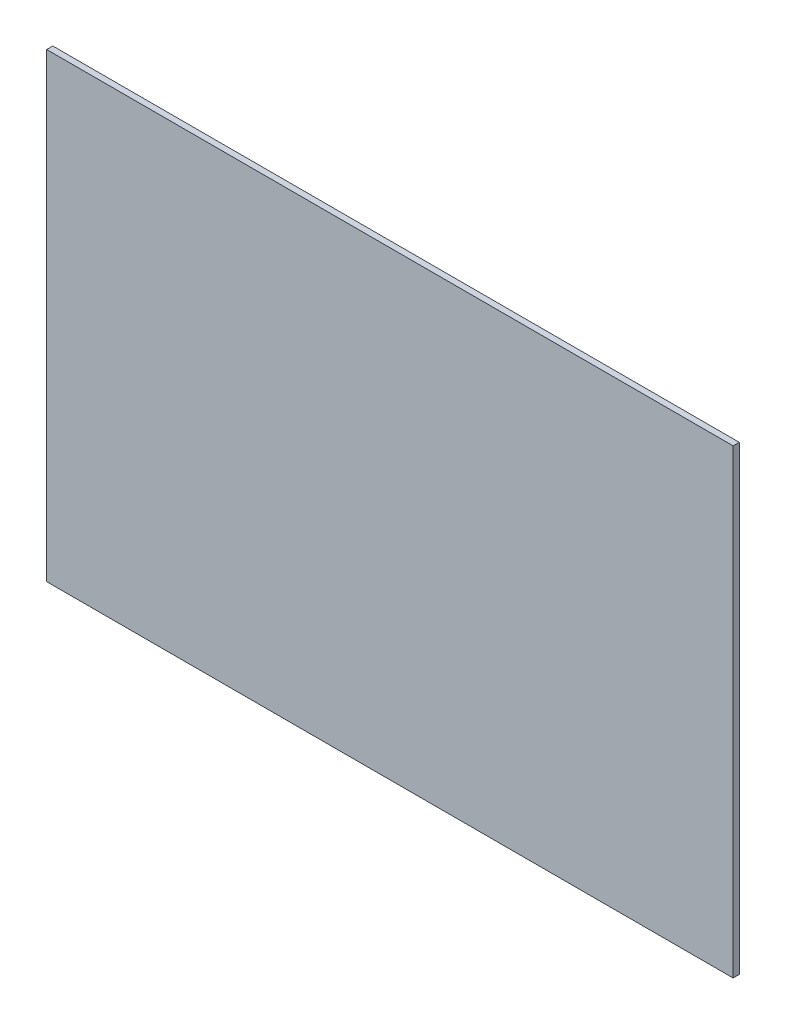
ISO-10303-21;
HEADER;
FILE_DESCRIPTION(('STEP AP214'),'2;1');
FILE_NAME('part.step','',(''),(''),'','','');
FILE_SCHEMA(('AUTOMOTIVE_DESIGN { 1 0 10303 214 1 1 1 1 }'));
ENDSEC;
DATA;
#1=APPLICATION_CONTEXT('core data for automotive mechanical design processes');
#2=APPLICATION_PROTOCOL_DEFINITION('international standard','automotive_design',2000,#1);
#3=PRODUCT_CONTEXT('',#1,'mechanical');
#4=PRODUCT('Part','Part','',(#3));
#5=PRODUCT_RELATED_PRODUCT_CATEGORY('part','',(#4));
#6=PRODUCT_DEFINITION_FORMATION('','',#4);
#7=PRODUCT_DEFINITION_CONTEXT('part definition',#1,'design');
#8=PRODUCT_DEFINITION('design','',#6,#7);
#9=PRODUCT_DEFINITION_SHAPE('','',#8);
#10=(LENGTH_UNIT() NAMED_UNIT(*) SI_UNIT(.MILLI.,.METRE.));
#11=(NAMED_UNIT(*) PLANE_ANGLE_UNIT() SI_UNIT($,.RADIAN.));
#12=(NAMED_UNIT(*) SI_UNIT($,.STERADIAN.) SOLID_ANGLE_UNIT());
#13=UNCERTAINTY_MEASURE_WITH_UNIT(LENGTH_MEASURE(1.E-05),#10,'distance_accuracy_value','');
#14=(GEOMETRIC_REPRESENTATION_CONTEXT(3) GLOBAL_UNCERTAINTY_ASSIGNED_CONTEXT((#13)) GLOBAL_UNIT_ASSIGNED_CONTEXT((#10,
#11,#12)) REPRESENTATION_CONTEXT('',''));
#15=CARTESIAN_POINT('',(0.,0.,0.));
#16=DIRECTION('',(0.,0.,1.));
#17=DIRECTION('',(1.,0.,0.));
#18=AXIS2_PLACEMENT_3D('',#15,#16,#17);
#19=CARTESIAN_POINT('',(-335.75625,225.425,3.));
#20=DIRECTION('',(1.,0.,0.));
#21=DIRECTION('',(0.,0.,-1.));
#22=AXIS2_PLACEMENT_3D('',#19,#20,#21);
#23=PLANE('',#22);
#24=DIRECTION('',(0.,-1.,0.));
#25=VECTOR('',#24,1.);
#26=CARTESIAN_POINT('',(-335.75625,225.425,-3.));
#27=LINE('',#26,#25);
#28=CARTESIAN_POINT('',(-335.75625,225.425,-3.));
#29=VERTEX_POINT('',#28);
#30=CARTESIAN_POINT('',(-335.75625,-225.425,-3.));
#31=VERTEX_POINT('',#30);
#32=EDGE_CURVE('E105',#29,#31,#27,.T.);
#33=ORIENTED_EDGE('',*,*,#32,.T.);
#34=DIRECTION('',(0.,0.,-1.));
#35=VECTOR('',#34,1.);
#36=CARTESIAN_POINT('',(-335.75625,-225.425,3.));
#37=LINE('',#36,#35);
#38=CARTESIAN_POINT('',(-335.75625,-225.425,3.));
#39=VERTEX_POINT('',#38);
#40=EDGE_CURVE('E11',#39,#31,#37,.T.);
#41=ORIENTED_EDGE('',*,*,#40,.F.);
#42=DIRECTION('',(0.,-1.,0.));
#43=VECTOR('',#42,1.);
#44=CARTESIAN_POINT('',(-335.75625,225.425,3.));
#45=LINE('',#44,#43);
#46=CARTESIAN_POINT('',(-335.75625,225.425,3.));
#47=VERTEX_POINT('',#46);
#48=EDGE_CURVE('E88',#47,#39,#45,.T.);
#49=ORIENTED_EDGE('',*,*,#48,.F.);
#50=DIRECTION('',(0.,0.,-1.));
#51=VECTOR('',#50,1.);
#52=CARTESIAN_POINT('',(-335.75625,225.425,3.));
#53=LINE('',#52,#51);
#54=EDGE_CURVE('E101',#47,#29,#53,.T.);
#55=ORIENTED_EDGE('',*,*,#54,.T.);
#56=EDGE_LOOP('',(#33,#41,#49,#55));
#57=FACE_BOUND('',#56,.T.);
#58=ADVANCED_FACE('F36',(#57),#23,.F.);
#59=CARTESIAN_POINT('',(335.75625,-225.425,3.));
#60=DIRECTION('',(0.,1.,0.));
#61=DIRECTION('',(-1.,0.,0.));
#62=AXIS2_PLACEMENT_3D('',#59,#60,#61);
#63=PLANE('',#62);
#64=DIRECTION('',(1.,0.,0.));
#65=VECTOR('',#64,1.);
#66=CARTESIAN_POINT('',(335.75625,-225.425,-3.));
#67=LINE('',#66,#65);
#68=CARTESIAN_POINT('',(335.75625,-225.425,-3.));
#69=VERTEX_POINT('',#68);
#70=EDGE_CURVE('E93',#31,#69,#67,.T.);
#71=ORIENTED_EDGE('',*,*,#70,.T.);
#72=DIRECTION('',(0.,0.,-1.));
#73=VECTOR('',#72,1.);
#74=CARTESIAN_POINT('',(335.75625,-225.425,3.));
#75=LINE('',#74,#73);
#76=CARTESIAN_POINT('',(335.75625,-225.425,3.));
#77=VERTEX_POINT('',#76);
#78=EDGE_CURVE('E45',#77,#69,#75,.T.);
#79=ORIENTED_EDGE('',*,*,#78,.F.);
#80=DIRECTION('',(1.,0.,0.));
#81=VECTOR('',#80,1.);
#82=CARTESIAN_POINT('',(335.75625,-225.425,3.));
#83=LINE('',#82,#81);
#84=EDGE_CURVE('E83',#39,#77,#83,.T.);
#85=ORIENTED_EDGE('',*,*,#84,.F.);
#86=ORIENTED_EDGE('',*,*,#40,.T.);
#87=EDGE_LOOP('',(#71,#79,#85,#86));
#88=FACE_BOUND('',#87,.T.);
#89=ADVANCED_FACE('F92',(#88),#63,.F.);
#90=CARTESIAN_POINT('',(335.75625,225.425,3.));
#91=DIRECTION('',(-1.,0.,0.));
#92=DIRECTION('',(0.,-1.,0.));
#93=AXIS2_PLACEMENT_3D('',#90,#91,#92);
#94=PLANE('',#93);
#95=DIRECTION('',(0.,1.,0.));
#96=VECTOR('',#95,1.);
#97=CARTESIAN_POINT('',(335.75625,225.425,-3.));
#98=LINE('',#97,#96);
#99=CARTESIAN_POINT('',(335.75625,225.425,-3.));
#100=VERTEX_POINT('',#99);
#101=EDGE_CURVE('E70',#69,#100,#98,.T.);
#102=ORIENTED_EDGE('',*,*,#101,.T.);
#103=DIRECTION('',(0.,0.,-1.));
#104=VECTOR('',#103,1.);
#105=CARTESIAN_POINT('',(335.75625,225.425,3.));
#106=LINE('',#105,#104);
#107=CARTESIAN_POINT('',(335.75625,225.425,3.));
#108=VERTEX_POINT('',#107);
#109=EDGE_CURVE('E95',#108,#100,#106,.T.);
#110=ORIENTED_EDGE('',*,*,#109,.F.);
#111=DIRECTION('',(0.,1.,0.));
#112=VECTOR('',#111,1.);
#113=CARTESIAN_POINT('',(335.75625,225.425,3.));
#114=LINE('',#113,#112);
#115=EDGE_CURVE('E86',#77,#108,#114,.T.);
#116=ORIENTED_EDGE('',*,*,#115,.F.);
#117=ORIENTED_EDGE('',*,*,#78,.T.);
#118=EDGE_LOOP('',(#102,#110,#116,#117));
#119=FACE_BOUND('',#118,.T.);
#120=ADVANCED_FACE('F96',(#119),#94,.F.);
#121=CARTESIAN_POINT('',(335.75625,225.425,3.));
#122=DIRECTION('',(0.,-1.,0.));
#123=DIRECTION('',(1.,0.,0.));
#124=AXIS2_PLACEMENT_3D('',#121,#122,#123);
#125=PLANE('',#124);
#126=DIRECTION('',(-1.,0.,0.));
#127=VECTOR('',#126,1.);
#128=CARTESIAN_POINT('',(335.75625,225.425,-3.));
#129=LINE('',#128,#127);
#130=EDGE_CURVE('E76',#100,#29,#129,.T.);
#131=ORIENTED_EDGE('',*,*,#130,.T.);
#132=ORIENTED_EDGE('',*,*,#54,.F.);
#133=DIRECTION('',(-1.,0.,0.));
#134=VECTOR('',#133,1.);
#135=CARTESIAN_POINT('',(335.75625,225.425,3.));
#136=LINE('',#135,#134);
#137=EDGE_CURVE('E53',#108,#47,#136,.T.);
#138=ORIENTED_EDGE('',*,*,#137,.F.);
#139=ORIENTED_EDGE('',*,*,#109,.T.);
#140=EDGE_LOOP('',(#131,#132,#138,#139));
#141=FACE_BOUND('',#140,.T.);
#142=ADVANCED_FACE('F119',(#141),#125,.F.);
#143=CARTESIAN_POINT('',(0.,0.,3.));
#144=DIRECTION('',(0.,0.,-1.));
#145=DIRECTION('',(-1.,0.,0.));
#146=AXIS2_PLACEMENT_3D('',#143,#144,#145);
#147=PLANE('',#146);
#148=ORIENTED_EDGE('',*,*,#48,.T.);
#149=ORIENTED_EDGE('',*,*,#84,.T.);
#150=ORIENTED_EDGE('',*,*,#115,.T.);
#151=ORIENTED_EDGE('',*,*,#137,.T.);
#152=EDGE_LOOP('',(#148,#149,#150,#151));
#153=FACE_BOUND('',#152,.T.);
#154=ADVANCED_FACE('F84',(#153),#147,.F.);
#155=CARTESIAN_POINT('',(0.,0.,-3.));
#156=DIRECTION('',(0.,0.,-1.));
#157=DIRECTION('',(-1.,0.,0.));
#158=AXIS2_PLACEMENT_3D('',#155,#156,#157);
#159=PLANE('',#158);
#160=ORIENTED_EDGE('',*,*,#32,.F.);
#161=ORIENTED_EDGE('',*,*,#130,.F.);
#162=ORIENTED_EDGE('',*,*,#101,.F.);
#163=ORIENTED_EDGE('',*,*,#70,.F.);
#164=EDGE_LOOP('',(#160,#161,#162,#163));
#165=FACE_BOUND('',#164,.T.);
#166=ADVANCED_FACE('F122',(#165),#159,.T.);
#167=CLOSED_SHELL('',(#58,#89,#120,#142,#154,#166));
#168=MANIFOLD_SOLID_BREP('B2',#167);
#169=ADVANCED_BREP_SHAPE_REPRESENTATION('',(#18,#168),#14);
#170=SHAPE_DEFINITION_REPRESENTATION(#9,#169);
ENDSEC;
END-ISO-10303-21;
